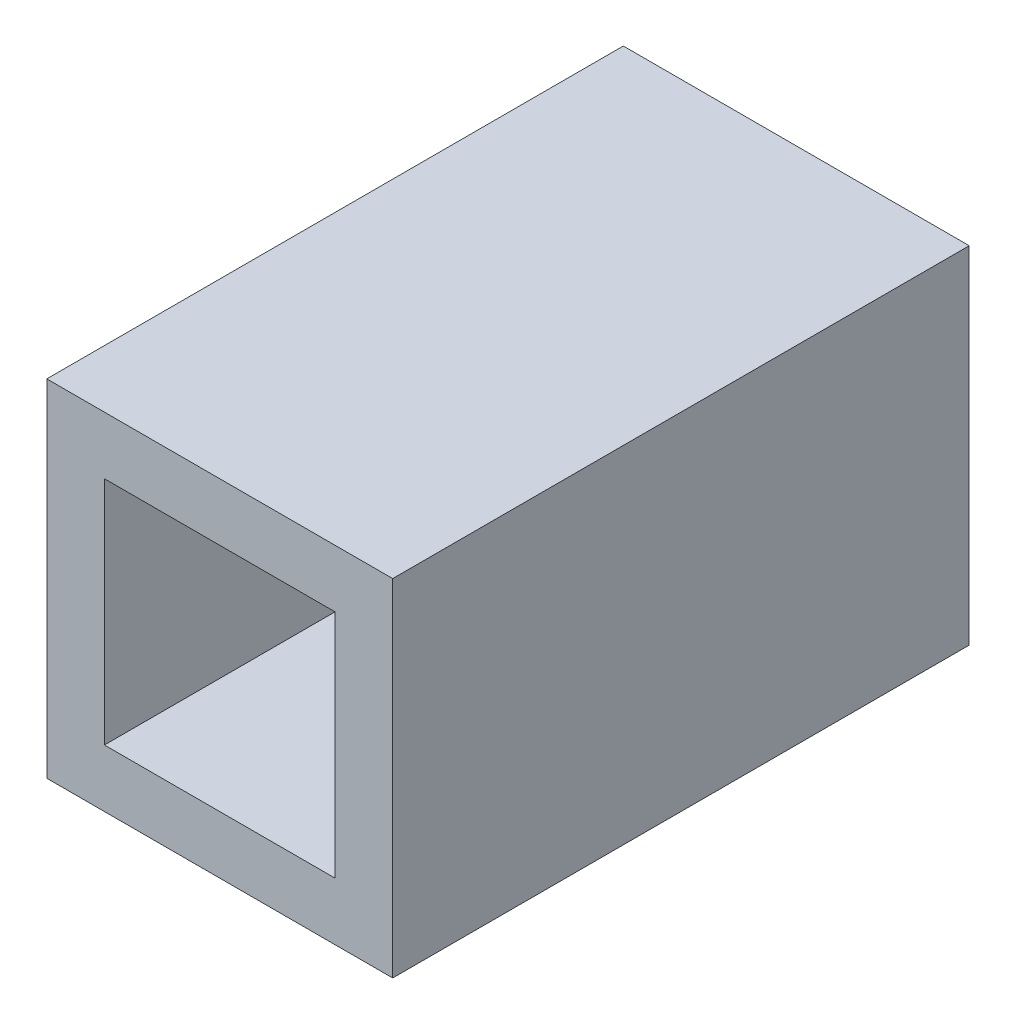
ISO-10303-21;
HEADER;
FILE_DESCRIPTION(('STEP AP214'),'2;1');
FILE_NAME('part.step','',(''),(''),'','','');
FILE_SCHEMA(('AUTOMOTIVE_DESIGN { 1 0 10303 214 1 1 1 1 }'));
ENDSEC;
DATA;
#1=APPLICATION_CONTEXT('core data for automotive mechanical design processes');
#2=APPLICATION_PROTOCOL_DEFINITION('international standard','automotive_design',2000,#1);
#3=PRODUCT_CONTEXT('',#1,'mechanical');
#4=PRODUCT('Part','Part','',(#3));
#5=PRODUCT_RELATED_PRODUCT_CATEGORY('part','',(#4));
#6=PRODUCT_DEFINITION_FORMATION('','',#4);
#7=PRODUCT_DEFINITION_CONTEXT('part definition',#1,'design');
#8=PRODUCT_DEFINITION('design','',#6,#7);
#9=PRODUCT_DEFINITION_SHAPE('','',#8);
#10=(LENGTH_UNIT() NAMED_UNIT(*) SI_UNIT(.MILLI.,.METRE.));
#11=(NAMED_UNIT(*) PLANE_ANGLE_UNIT() SI_UNIT($,.RADIAN.));
#12=(NAMED_UNIT(*) SI_UNIT($,.STERADIAN.) SOLID_ANGLE_UNIT());
#13=UNCERTAINTY_MEASURE_WITH_UNIT(LENGTH_MEASURE(1.E-05),#10,'distance_accuracy_value','');
#14=(GEOMETRIC_REPRESENTATION_CONTEXT(3) GLOBAL_UNCERTAINTY_ASSIGNED_CONTEXT((#13)) GLOBAL_UNIT_ASSIGNED_CONTEXT((#10,
#11,#12)) REPRESENTATION_CONTEXT('',''));
#15=CARTESIAN_POINT('',(0.,0.,0.));
#16=DIRECTION('',(0.,0.,1.));
#17=DIRECTION('',(1.,0.,0.));
#18=AXIS2_PLACEMENT_3D('',#15,#16,#17);
#19=CARTESIAN_POINT('',(0.,0.,10.));
#20=DIRECTION('',(0.,0.,-1.));
#21=DIRECTION('',(-1.,0.,0.));
#22=AXIS2_PLACEMENT_3D('',#19,#20,#21);
#23=PLANE('',#22);
#24=DIRECTION('',(0.,1.,0.));
#25=VECTOR('',#24,1.);
#26=CARTESIAN_POINT('',(5.,5.,10.));
#27=LINE('',#26,#25);
#28=CARTESIAN_POINT('',(5.,-1.,10.));
#29=VERTEX_POINT('',#28);
#30=CARTESIAN_POINT('',(5.,5.,10.));
#31=VERTEX_POINT('',#30);
#32=EDGE_CURVE('E136',#29,#31,#27,.T.);
#33=ORIENTED_EDGE('',*,*,#32,.T.);
#34=DIRECTION('',(-1.,0.,0.));
#35=VECTOR('',#34,1.);
#36=CARTESIAN_POINT('',(5.,5.,10.));
#37=LINE('',#36,#35);
#38=CARTESIAN_POINT('',(-1.,5.,10.));
#39=VERTEX_POINT('',#38);
#40=EDGE_CURVE('E139',#31,#39,#37,.T.);
#41=ORIENTED_EDGE('',*,*,#40,.T.);
#42=DIRECTION('',(0.,-1.,0.));
#43=VECTOR('',#42,1.);
#44=CARTESIAN_POINT('',(-1.,5.,10.));
#45=LINE('',#44,#43);
#46=CARTESIAN_POINT('',(-1.,-1.,10.));
#47=VERTEX_POINT('',#46);
#48=EDGE_CURVE('E142',#39,#47,#45,.T.);
#49=ORIENTED_EDGE('',*,*,#48,.T.);
#50=DIRECTION('',(1.,0.,0.));
#51=VECTOR('',#50,1.);
#52=CARTESIAN_POINT('',(5.,-1.,10.));
#53=LINE('',#52,#51);
#54=EDGE_CURVE('E144',#47,#29,#53,.T.);
#55=ORIENTED_EDGE('',*,*,#54,.T.);
#56=EDGE_LOOP('',(#33,#41,#49,#55));
#57=FACE_BOUND('',#56,.T.);
#58=DIRECTION('',(0.,-1.,0.));
#59=VECTOR('',#58,1.);
#60=CARTESIAN_POINT('',(0.,0.,10.));
#61=LINE('',#60,#59);
#62=CARTESIAN_POINT('',(0.,4.,10.));
#63=VERTEX_POINT('',#62);
#64=CARTESIAN_POINT('',(0.,0.,10.));
#65=VERTEX_POINT('',#64);
#66=EDGE_CURVE('E100',#63,#65,#61,.T.);
#67=ORIENTED_EDGE('',*,*,#66,.F.);
#68=DIRECTION('',(-1.,0.,0.));
#69=VECTOR('',#68,1.);
#70=CARTESIAN_POINT('',(0.,4.,10.));
#71=LINE('',#70,#69);
#72=CARTESIAN_POINT('',(4.,4.,10.));
#73=VERTEX_POINT('',#72);
#74=EDGE_CURVE('E122',#73,#63,#71,.T.);
#75=ORIENTED_EDGE('',*,*,#74,.F.);
#76=DIRECTION('',(0.,1.,0.));
#77=VECTOR('',#76,1.);
#78=CARTESIAN_POINT('',(4.,0.,10.));
#79=LINE('',#78,#77);
#80=CARTESIAN_POINT('',(4.,0.,10.));
#81=VERTEX_POINT('',#80);
#82=EDGE_CURVE('E120',#81,#73,#79,.T.);
#83=ORIENTED_EDGE('',*,*,#82,.F.);
#84=DIRECTION('',(1.,0.,0.));
#85=VECTOR('',#84,1.);
#86=CARTESIAN_POINT('',(0.,0.,10.));
#87=LINE('',#86,#85);
#88=EDGE_CURVE('E108',#65,#81,#87,.T.);
#89=ORIENTED_EDGE('',*,*,#88,.F.);
#90=EDGE_LOOP('',(#67,#75,#83,#89));
#91=FACE_BOUND('',#90,.T.);
#92=ADVANCED_FACE('F35',(#57,#91),#23,.F.);
#93=CARTESIAN_POINT('',(0.,0.,0.));
#94=DIRECTION('',(0.,0.,-1.));
#95=DIRECTION('',(-1.,0.,0.));
#96=AXIS2_PLACEMENT_3D('',#93,#94,#95);
#97=PLANE('',#96);
#98=DIRECTION('',(0.,1.,0.));
#99=VECTOR('',#98,1.);
#100=CARTESIAN_POINT('',(5.,5.,0.));
#101=LINE('',#100,#99);
#102=CARTESIAN_POINT('',(5.,-1.,0.));
#103=VERTEX_POINT('',#102);
#104=CARTESIAN_POINT('',(5.,5.,0.));
#105=VERTEX_POINT('',#104);
#106=EDGE_CURVE('E116',#103,#105,#101,.T.);
#107=ORIENTED_EDGE('',*,*,#106,.F.);
#108=DIRECTION('',(1.,0.,0.));
#109=VECTOR('',#108,1.);
#110=CARTESIAN_POINT('',(5.,-1.,0.));
#111=LINE('',#110,#109);
#112=CARTESIAN_POINT('',(-1.,-1.,0.));
#113=VERTEX_POINT('',#112);
#114=EDGE_CURVE('E140',#113,#103,#111,.T.);
#115=ORIENTED_EDGE('',*,*,#114,.F.);
#116=DIRECTION('',(0.,-1.,0.));
#117=VECTOR('',#116,1.);
#118=CARTESIAN_POINT('',(-1.,5.,0.));
#119=LINE('',#118,#117);
#120=CARTESIAN_POINT('',(-1.,5.,0.));
#121=VERTEX_POINT('',#120);
#122=EDGE_CURVE('E151',#121,#113,#119,.T.);
#123=ORIENTED_EDGE('',*,*,#122,.F.);
#124=DIRECTION('',(-1.,0.,0.));
#125=VECTOR('',#124,1.);
#126=CARTESIAN_POINT('',(5.,5.,0.));
#127=LINE('',#126,#125);
#128=EDGE_CURVE('E149',#105,#121,#127,.T.);
#129=ORIENTED_EDGE('',*,*,#128,.F.);
#130=EDGE_LOOP('',(#107,#115,#123,#129));
#131=FACE_BOUND('',#130,.T.);
#132=DIRECTION('',(-1.,0.,0.));
#133=VECTOR('',#132,1.);
#134=CARTESIAN_POINT('',(0.,4.,0.));
#135=LINE('',#134,#133);
#136=CARTESIAN_POINT('',(4.,4.,0.));
#137=VERTEX_POINT('',#136);
#138=CARTESIAN_POINT('',(0.,4.,0.));
#139=VERTEX_POINT('',#138);
#140=EDGE_CURVE('E109',#137,#139,#135,.T.);
#141=ORIENTED_EDGE('',*,*,#140,.T.);
#142=DIRECTION('',(0.,-1.,0.));
#143=VECTOR('',#142,1.);
#144=CARTESIAN_POINT('',(0.,0.,0.));
#145=LINE('',#144,#143);
#146=CARTESIAN_POINT('',(0.,0.,0.));
#147=VERTEX_POINT('',#146);
#148=EDGE_CURVE('E58',#139,#147,#145,.T.);
#149=ORIENTED_EDGE('',*,*,#148,.T.);
#150=DIRECTION('',(1.,0.,0.));
#151=VECTOR('',#150,1.);
#152=CARTESIAN_POINT('',(0.,0.,0.));
#153=LINE('',#152,#151);
#154=CARTESIAN_POINT('',(4.,0.,0.));
#155=VERTEX_POINT('',#154);
#156=EDGE_CURVE('E115',#147,#155,#153,.T.);
#157=ORIENTED_EDGE('',*,*,#156,.T.);
#158=DIRECTION('',(0.,1.,0.));
#159=VECTOR('',#158,1.);
#160=CARTESIAN_POINT('',(4.,0.,0.));
#161=LINE('',#160,#159);
#162=EDGE_CURVE('E128',#155,#137,#161,.T.);
#163=ORIENTED_EDGE('',*,*,#162,.T.);
#164=EDGE_LOOP('',(#141,#149,#157,#163));
#165=FACE_BOUND('',#164,.T.);
#166=ADVANCED_FACE('F169',(#131,#165),#97,.T.);
#167=CARTESIAN_POINT('',(5.,5.,10.));
#168=DIRECTION('',(-1.,0.,0.));
#169=DIRECTION('',(0.,-1.,0.));
#170=AXIS2_PLACEMENT_3D('',#167,#168,#169);
#171=PLANE('',#170);
#172=ORIENTED_EDGE('',*,*,#106,.T.);
#173=DIRECTION('',(0.,0.,-1.));
#174=VECTOR('',#173,1.);
#175=CARTESIAN_POINT('',(5.,5.,10.));
#176=LINE('',#175,#174);
#177=EDGE_CURVE('E11',#31,#105,#176,.T.);
#178=ORIENTED_EDGE('',*,*,#177,.F.);
#179=ORIENTED_EDGE('',*,*,#32,.F.);
#180=DIRECTION('',(0.,0.,-1.));
#181=VECTOR('',#180,1.);
#182=CARTESIAN_POINT('',(5.,-1.,10.));
#183=LINE('',#182,#181);
#184=EDGE_CURVE('E146',#29,#103,#183,.T.);
#185=ORIENTED_EDGE('',*,*,#184,.T.);
#186=EDGE_LOOP('',(#172,#178,#179,#185));
#187=FACE_BOUND('',#186,.T.);
#188=ADVANCED_FACE('F37',(#187),#171,.F.);
#189=CARTESIAN_POINT('',(5.,5.,10.));
#190=DIRECTION('',(0.,-1.,0.));
#191=DIRECTION('',(0.,0.,-1.));
#192=AXIS2_PLACEMENT_3D('',#189,#190,#191);
#193=PLANE('',#192);
#194=ORIENTED_EDGE('',*,*,#128,.T.);
#195=DIRECTION('',(0.,0.,-1.));
#196=VECTOR('',#195,1.);
#197=CARTESIAN_POINT('',(-1.,5.,10.));
#198=LINE('',#197,#196);
#199=EDGE_CURVE('E43',#39,#121,#198,.T.);
#200=ORIENTED_EDGE('',*,*,#199,.F.);
#201=ORIENTED_EDGE('',*,*,#40,.F.);
#202=ORIENTED_EDGE('',*,*,#177,.T.);
#203=EDGE_LOOP('',(#194,#200,#201,#202));
#204=FACE_BOUND('',#203,.T.);
#205=ADVANCED_FACE('F179',(#204),#193,.F.);
#206=CARTESIAN_POINT('',(-1.,5.,10.));
#207=DIRECTION('',(1.,0.,0.));
#208=DIRECTION('',(0.,1.,0.));
#209=AXIS2_PLACEMENT_3D('',#206,#207,#208);
#210=PLANE('',#209);
#211=ORIENTED_EDGE('',*,*,#122,.T.);
#212=DIRECTION('',(0.,0.,-1.));
#213=VECTOR('',#212,1.);
#214=CARTESIAN_POINT('',(-1.,-1.,10.));
#215=LINE('',#214,#213);
#216=EDGE_CURVE('E156',#47,#113,#215,.T.);
#217=ORIENTED_EDGE('',*,*,#216,.F.);
#218=ORIENTED_EDGE('',*,*,#48,.F.);
#219=ORIENTED_EDGE('',*,*,#199,.T.);
#220=EDGE_LOOP('',(#211,#217,#218,#219));
#221=FACE_BOUND('',#220,.T.);
#222=ADVANCED_FACE('F163',(#221),#210,.F.);
#223=CARTESIAN_POINT('',(5.,-1.,10.));
#224=DIRECTION('',(0.,1.,0.));
#225=DIRECTION('',(0.,0.,1.));
#226=AXIS2_PLACEMENT_3D('',#223,#224,#225);
#227=PLANE('',#226);
#228=ORIENTED_EDGE('',*,*,#114,.T.);
#229=ORIENTED_EDGE('',*,*,#184,.F.);
#230=ORIENTED_EDGE('',*,*,#54,.F.);
#231=ORIENTED_EDGE('',*,*,#216,.T.);
#232=EDGE_LOOP('',(#228,#229,#230,#231));
#233=FACE_BOUND('',#232,.T.);
#234=ADVANCED_FACE('F173',(#233),#227,.F.);
#235=CARTESIAN_POINT('',(0.,0.,10.));
#236=DIRECTION('',(1.,0.,0.));
#237=DIRECTION('',(0.,1.,0.));
#238=AXIS2_PLACEMENT_3D('',#235,#236,#237);
#239=PLANE('',#238);
#240=ORIENTED_EDGE('',*,*,#148,.F.);
#241=DIRECTION('',(0.,0.,-1.));
#242=VECTOR('',#241,1.);
#243=CARTESIAN_POINT('',(0.,4.,10.));
#244=LINE('',#243,#242);
#245=EDGE_CURVE('E104',#63,#139,#244,.T.);
#246=ORIENTED_EDGE('',*,*,#245,.F.);
#247=ORIENTED_EDGE('',*,*,#66,.T.);
#248=DIRECTION('',(0.,0.,-1.));
#249=VECTOR('',#248,1.);
#250=CARTESIAN_POINT('',(0.,0.,10.));
#251=LINE('',#250,#249);
#252=EDGE_CURVE('E103',#65,#147,#251,.T.);
#253=ORIENTED_EDGE('',*,*,#252,.T.);
#254=EDGE_LOOP('',(#240,#246,#247,#253));
#255=FACE_BOUND('',#254,.T.);
#256=ADVANCED_FACE('F102',(#255),#239,.T.);
#257=CARTESIAN_POINT('',(0.,0.,10.));
#258=DIRECTION('',(0.,1.,0.));
#259=DIRECTION('',(0.,0.,1.));
#260=AXIS2_PLACEMENT_3D('',#257,#258,#259);
#261=PLANE('',#260);
#262=ORIENTED_EDGE('',*,*,#156,.F.);
#263=ORIENTED_EDGE('',*,*,#252,.F.);
#264=ORIENTED_EDGE('',*,*,#88,.T.);
#265=DIRECTION('',(0.,0.,-1.));
#266=VECTOR('',#265,1.);
#267=CARTESIAN_POINT('',(4.,0.,10.));
#268=LINE('',#267,#266);
#269=EDGE_CURVE('E117',#81,#155,#268,.T.);
#270=ORIENTED_EDGE('',*,*,#269,.T.);
#271=EDGE_LOOP('',(#262,#263,#264,#270));
#272=FACE_BOUND('',#271,.T.);
#273=ADVANCED_FACE('F112',(#272),#261,.T.);
#274=CARTESIAN_POINT('',(4.,0.,10.));
#275=DIRECTION('',(-1.,0.,0.));
#276=DIRECTION('',(0.,-1.,0.));
#277=AXIS2_PLACEMENT_3D('',#274,#275,#276);
#278=PLANE('',#277);
#279=ORIENTED_EDGE('',*,*,#162,.F.);
#280=ORIENTED_EDGE('',*,*,#269,.F.);
#281=ORIENTED_EDGE('',*,*,#82,.T.);
#282=DIRECTION('',(0.,0.,-1.));
#283=VECTOR('',#282,1.);
#284=CARTESIAN_POINT('',(4.,4.,10.));
#285=LINE('',#284,#283);
#286=EDGE_CURVE('E50',#73,#137,#285,.T.);
#287=ORIENTED_EDGE('',*,*,#286,.T.);
#288=EDGE_LOOP('',(#279,#280,#281,#287));
#289=FACE_BOUND('',#288,.T.);
#290=ADVANCED_FACE('F202',(#289),#278,.T.);
#291=CARTESIAN_POINT('',(0.,4.,10.));
#292=DIRECTION('',(0.,-1.,0.));
#293=DIRECTION('',(0.,0.,-1.));
#294=AXIS2_PLACEMENT_3D('',#291,#292,#293);
#295=PLANE('',#294);
#296=ORIENTED_EDGE('',*,*,#140,.F.);
#297=ORIENTED_EDGE('',*,*,#286,.F.);
#298=ORIENTED_EDGE('',*,*,#74,.T.);
#299=ORIENTED_EDGE('',*,*,#245,.T.);
#300=EDGE_LOOP('',(#296,#297,#298,#299));
#301=FACE_BOUND('',#300,.T.);
#302=ADVANCED_FACE('F206',(#301),#295,.T.);
#303=CLOSED_SHELL('',(#92,#166,#188,#205,#222,#234,#256,#273,#290,#302));
#304=MANIFOLD_SOLID_BREP('B2',#303);
#305=ADVANCED_BREP_SHAPE_REPRESENTATION('',(#18,#304),#14);
#306=SHAPE_DEFINITION_REPRESENTATION(#9,#305);
ENDSEC;
END-ISO-10303-21;
